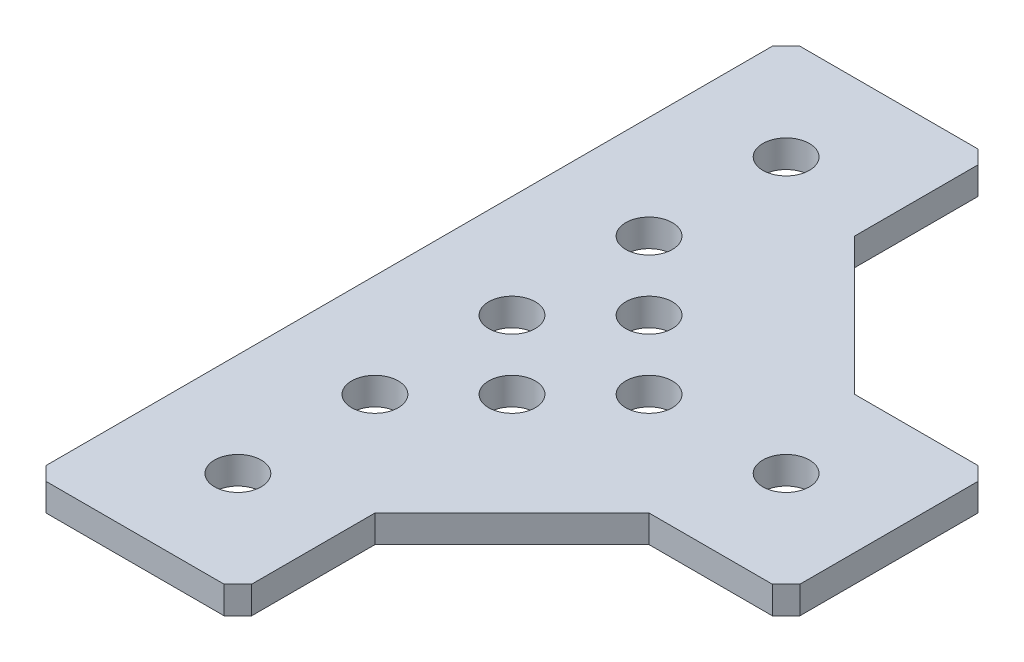
ISO-10303-21;
HEADER;
FILE_DESCRIPTION(('STEP AP214'),'2;1');
FILE_NAME('part.step','',(''),(''),'','','');
FILE_SCHEMA(('AUTOMOTIVE_DESIGN { 1 0 10303 214 1 1 1 1 }'));
ENDSEC;
DATA;
#1=APPLICATION_CONTEXT('core data for automotive mechanical design processes');
#2=APPLICATION_PROTOCOL_DEFINITION('international standard','automotive_design',2000,#1);
#3=PRODUCT_CONTEXT('',#1,'mechanical');
#4=PRODUCT('Part','Part','',(#3));
#5=PRODUCT_RELATED_PRODUCT_CATEGORY('part','',(#4));
#6=PRODUCT_DEFINITION_FORMATION('','',#4);
#7=PRODUCT_DEFINITION_CONTEXT('part definition',#1,'design');
#8=PRODUCT_DEFINITION('design','',#6,#7);
#9=PRODUCT_DEFINITION_SHAPE('','',#8);
#10=(LENGTH_UNIT() NAMED_UNIT(*) SI_UNIT(.MILLI.,.METRE.));
#11=(NAMED_UNIT(*) PLANE_ANGLE_UNIT() SI_UNIT($,.RADIAN.));
#12=(NAMED_UNIT(*) SI_UNIT($,.STERADIAN.) SOLID_ANGLE_UNIT());
#13=UNCERTAINTY_MEASURE_WITH_UNIT(LENGTH_MEASURE(1.E-05),#10,'distance_accuracy_value','');
#14=(GEOMETRIC_REPRESENTATION_CONTEXT(3) GLOBAL_UNCERTAINTY_ASSIGNED_CONTEXT((#13)) GLOBAL_UNIT_ASSIGNED_CONTEXT((#10,
#11,#12)) REPRESENTATION_CONTEXT('',''));
#15=CARTESIAN_POINT('',(0.,0.,0.));
#16=DIRECTION('',(0.,0.,1.));
#17=DIRECTION('',(1.,0.,0.));
#18=AXIS2_PLACEMENT_3D('',#15,#16,#17);
#19=CARTESIAN_POINT('',(27.5,2.,6.49999999999989));
#20=DIRECTION('',(-0.707106781186551,0.,-0.707106781186544));
#21=DIRECTION('',(-0.707106781186544,0.,0.707106781186551));
#22=AXIS2_PLACEMENT_3D('',#19,#20,#21);
#23=PLANE('',#22);
#24=DIRECTION('',(0.,1.,0.));
#25=VECTOR('',#24,1.);
#26=CARTESIAN_POINT('',(26.5,2.,7.49999999999991));
#27=LINE('',#26,#25);
#28=CARTESIAN_POINT('',(26.5,2.,7.49999999999992));
#29=VERTEX_POINT('',#28);
#30=CARTESIAN_POINT('',(26.5,0.,7.49999999999992));
#31=VERTEX_POINT('',#30);
#32=EDGE_CURVE('E131',#29,#31,#27,.F.);
#33=ORIENTED_EDGE('',*,*,#32,.T.);
#34=DIRECTION('',(0.707106781186544,0.,-0.707106781186551));
#35=VECTOR('',#34,1.);
#36=CARTESIAN_POINT('',(26.5,0.,7.49999999999991));
#37=LINE('',#36,#35);
#38=CARTESIAN_POINT('',(27.5,0.,6.49999999999989));
#39=VERTEX_POINT('',#38);
#40=EDGE_CURVE('E134',#31,#39,#37,.T.);
#41=ORIENTED_EDGE('',*,*,#40,.T.);
#42=DIRECTION('',(0.,1.,0.));
#43=VECTOR('',#42,1.);
#44=CARTESIAN_POINT('',(27.5,2.,6.49999999999989));
#45=LINE('',#44,#43);
#46=CARTESIAN_POINT('',(27.5,2.,6.49999999999989));
#47=VERTEX_POINT('',#46);
#48=EDGE_CURVE('E541',#39,#47,#45,.T.);
#49=ORIENTED_EDGE('',*,*,#48,.T.);
#50=DIRECTION('',(-0.707106781186544,0.,0.707106781186551));
#51=VECTOR('',#50,1.);
#52=CARTESIAN_POINT('',(27.5,2.,6.49999999999989));
#53=LINE('',#52,#51);
#54=EDGE_CURVE('E136',#29,#47,#53,.F.);
#55=ORIENTED_EDGE('',*,*,#54,.F.);
#56=EDGE_LOOP('',(#33,#41,#49,#55));
#57=FACE_BOUND('',#56,.T.);
#58=ADVANCED_FACE('F17',(#57),#23,.F.);
#59=CARTESIAN_POINT('',(26.5000000000001,2.,-7.5));
#60=DIRECTION('',(-0.707106781186545,0.,0.70710678118655));
#61=DIRECTION('',(0.70710678118655,0.,0.707106781186545));
#62=AXIS2_PLACEMENT_3D('',#59,#60,#61);
#63=PLANE('',#62);
#64=DIRECTION('',(0.,1.,0.));
#65=VECTOR('',#64,1.);
#66=CARTESIAN_POINT('',(27.5,2.,-6.5000000000001));
#67=LINE('',#66,#65);
#68=CARTESIAN_POINT('',(27.5,2.,-6.50000000000009));
#69=VERTEX_POINT('',#68);
#70=CARTESIAN_POINT('',(27.5,0.,-6.50000000000009));
#71=VERTEX_POINT('',#70);
#72=EDGE_CURVE('E126',#69,#71,#67,.F.);
#73=ORIENTED_EDGE('',*,*,#72,.T.);
#74=DIRECTION('',(-0.70710678118655,0.,-0.707106781186545));
#75=VECTOR('',#74,1.);
#76=CARTESIAN_POINT('',(27.5,0.,-6.5000000000001));
#77=LINE('',#76,#75);
#78=CARTESIAN_POINT('',(26.5000000000001,0.,-7.5));
#79=VERTEX_POINT('',#78);
#80=EDGE_CURVE('E168',#71,#79,#77,.T.);
#81=ORIENTED_EDGE('',*,*,#80,.T.);
#82=DIRECTION('',(0.,1.,0.));
#83=VECTOR('',#82,1.);
#84=CARTESIAN_POINT('',(26.5000000000001,2.,-7.5));
#85=LINE('',#84,#83);
#86=CARTESIAN_POINT('',(26.5000000000001,2.,-7.5));
#87=VERTEX_POINT('',#86);
#88=EDGE_CURVE('E535',#79,#87,#85,.T.);
#89=ORIENTED_EDGE('',*,*,#88,.T.);
#90=DIRECTION('',(0.70710678118655,0.,0.707106781186545));
#91=VECTOR('',#90,1.);
#92=CARTESIAN_POINT('',(26.5000000000001,2.,-7.5));
#93=LINE('',#92,#91);
#94=EDGE_CURVE('E178',#69,#87,#93,.F.);
#95=ORIENTED_EDGE('',*,*,#94,.F.);
#96=EDGE_LOOP('',(#73,#81,#89,#95));
#97=FACE_BOUND('',#96,.T.);
#98=ADVANCED_FACE('F481',(#97),#63,.F.);
#99=CARTESIAN_POINT('',(6.49999999999999,2.,-27.5));
#100=DIRECTION('',(-0.707106781186549,0.,0.707106781186546));
#101=DIRECTION('',(0.707106781186546,0.,0.707106781186549));
#102=AXIS2_PLACEMENT_3D('',#99,#100,#101);
#103=PLANE('',#102);
#104=DIRECTION('',(0.,1.,0.));
#105=VECTOR('',#104,1.);
#106=CARTESIAN_POINT('',(7.50000000000001,2.,-26.5));
#107=LINE('',#106,#105);
#108=CARTESIAN_POINT('',(7.50000000000001,2.,-26.5));
#109=VERTEX_POINT('',#108);
#110=CARTESIAN_POINT('',(7.50000000000001,0.,-26.5));
#111=VERTEX_POINT('',#110);
#112=EDGE_CURVE('E507',#109,#111,#107,.F.);
#113=ORIENTED_EDGE('',*,*,#112,.T.);
#114=DIRECTION('',(-0.707106781186546,0.,-0.707106781186549));
#115=VECTOR('',#114,1.);
#116=CARTESIAN_POINT('',(7.50000000000001,0.,-26.5));
#117=LINE('',#116,#115);
#118=CARTESIAN_POINT('',(6.49999999999999,0.,-27.5));
#119=VERTEX_POINT('',#118);
#120=EDGE_CURVE('E166',#111,#119,#117,.T.);
#121=ORIENTED_EDGE('',*,*,#120,.T.);
#122=DIRECTION('',(0.,1.,0.));
#123=VECTOR('',#122,1.);
#124=CARTESIAN_POINT('',(6.49999999999999,2.,-27.5));
#125=LINE('',#124,#123);
#126=CARTESIAN_POINT('',(6.49999999999999,2.,-27.5));
#127=VERTEX_POINT('',#126);
#128=EDGE_CURVE('E580',#119,#127,#125,.T.);
#129=ORIENTED_EDGE('',*,*,#128,.T.);
#130=DIRECTION('',(0.707106781186546,0.,0.707106781186549));
#131=VECTOR('',#130,1.);
#132=CARTESIAN_POINT('',(6.49999999999999,2.,-27.5));
#133=LINE('',#132,#131);
#134=EDGE_CURVE('E176',#109,#127,#133,.F.);
#135=ORIENTED_EDGE('',*,*,#134,.F.);
#136=EDGE_LOOP('',(#113,#121,#129,#135));
#137=FACE_BOUND('',#136,.T.);
#138=ADVANCED_FACE('F472',(#137),#103,.F.);
#139=CARTESIAN_POINT('',(-7.49999999999999,2.,-26.5));
#140=DIRECTION('',(0.707106781186546,0.,0.707106781186549));
#141=DIRECTION('',(0.707106781186549,0.,-0.707106781186546));
#142=AXIS2_PLACEMENT_3D('',#139,#140,#141);
#143=PLANE('',#142);
#144=DIRECTION('',(0.,1.,0.));
#145=VECTOR('',#144,1.);
#146=CARTESIAN_POINT('',(-6.5,2.,-27.5));
#147=LINE('',#146,#145);
#148=CARTESIAN_POINT('',(-6.5,2.,-27.5));
#149=VERTEX_POINT('',#148);
#150=CARTESIAN_POINT('',(-6.5,0.,-27.5));
#151=VERTEX_POINT('',#150);
#152=EDGE_CURVE('E524',#149,#151,#147,.F.);
#153=ORIENTED_EDGE('',*,*,#152,.T.);
#154=DIRECTION('',(-0.70710678118655,0.,0.707106781186545));
#155=VECTOR('',#154,1.);
#156=CARTESIAN_POINT('',(-6.50000000000001,0.,-27.5));
#157=LINE('',#156,#155);
#158=CARTESIAN_POINT('',(-7.5,0.,-26.5));
#159=VERTEX_POINT('',#158);
#160=EDGE_CURVE('E164',#151,#159,#157,.T.);
#161=ORIENTED_EDGE('',*,*,#160,.T.);
#162=DIRECTION('',(0.,1.,0.));
#163=VECTOR('',#162,1.);
#164=CARTESIAN_POINT('',(-7.49999999999999,2.,-26.5));
#165=LINE('',#164,#163);
#166=CARTESIAN_POINT('',(-7.5,2.,-26.5));
#167=VERTEX_POINT('',#166);
#168=EDGE_CURVE('E572',#159,#167,#165,.T.);
#169=ORIENTED_EDGE('',*,*,#168,.T.);
#170=DIRECTION('',(0.707106781186549,0.,-0.707106781186546));
#171=VECTOR('',#170,1.);
#172=CARTESIAN_POINT('',(-7.49999999999999,2.,-26.5));
#173=LINE('',#172,#171);
#174=EDGE_CURVE('E174',#149,#167,#173,.F.);
#175=ORIENTED_EDGE('',*,*,#174,.F.);
#176=EDGE_LOOP('',(#153,#161,#169,#175));
#177=FACE_BOUND('',#176,.T.);
#178=ADVANCED_FACE('F463',(#177),#143,.F.);
#179=CARTESIAN_POINT('',(-6.49999999999999,2.,27.5));
#180=DIRECTION('',(0.707106781186549,0.,-0.707106781186546));
#181=DIRECTION('',(-0.707106781186546,0.,-0.707106781186549));
#182=AXIS2_PLACEMENT_3D('',#179,#180,#181);
#183=PLANE('',#182);
#184=DIRECTION('',(0.,1.,0.));
#185=VECTOR('',#184,1.);
#186=CARTESIAN_POINT('',(-7.50000000000001,2.,26.5));
#187=LINE('',#186,#185);
#188=CARTESIAN_POINT('',(-7.5,2.,26.5));
#189=VERTEX_POINT('',#188);
#190=CARTESIAN_POINT('',(-7.5,0.,26.5));
#191=VERTEX_POINT('',#190);
#192=EDGE_CURVE('E578',#189,#191,#187,.F.);
#193=ORIENTED_EDGE('',*,*,#192,.T.);
#194=DIRECTION('',(0.707106781186546,0.,0.707106781186549));
#195=VECTOR('',#194,1.);
#196=CARTESIAN_POINT('',(-7.50000000000001,0.,26.5));
#197=LINE('',#196,#195);
#198=CARTESIAN_POINT('',(-6.49999999999999,0.,27.5));
#199=VERTEX_POINT('',#198);
#200=EDGE_CURVE('E162',#191,#199,#197,.T.);
#201=ORIENTED_EDGE('',*,*,#200,.T.);
#202=DIRECTION('',(0.,1.,0.));
#203=VECTOR('',#202,1.);
#204=CARTESIAN_POINT('',(-6.49999999999999,2.,27.5));
#205=LINE('',#204,#203);
#206=CARTESIAN_POINT('',(-6.49999999999999,2.,27.5));
#207=VERTEX_POINT('',#206);
#208=EDGE_CURVE('E564',#199,#207,#205,.T.);
#209=ORIENTED_EDGE('',*,*,#208,.T.);
#210=DIRECTION('',(-0.707106781186546,0.,-0.707106781186549));
#211=VECTOR('',#210,1.);
#212=CARTESIAN_POINT('',(-6.49999999999999,2.,27.5));
#213=LINE('',#212,#211);
#214=EDGE_CURVE('E172',#189,#207,#213,.F.);
#215=ORIENTED_EDGE('',*,*,#214,.F.);
#216=EDGE_LOOP('',(#193,#201,#209,#215));
#217=FACE_BOUND('',#216,.T.);
#218=ADVANCED_FACE('F454',(#217),#183,.F.);
#219=CARTESIAN_POINT('',(7.50000000000001,2.,26.5));
#220=DIRECTION('',(-0.707106781186546,0.,-0.707106781186549));
#221=DIRECTION('',(-0.707106781186549,0.,0.707106781186546));
#222=AXIS2_PLACEMENT_3D('',#219,#220,#221);
#223=PLANE('',#222);
#224=DIRECTION('',(0.,1.,0.));
#225=VECTOR('',#224,1.);
#226=CARTESIAN_POINT('',(6.50000000000001,2.,27.5));
#227=LINE('',#226,#225);
#228=CARTESIAN_POINT('',(6.50000000000001,2.,27.5));
#229=VERTEX_POINT('',#228);
#230=CARTESIAN_POINT('',(6.50000000000001,0.,27.5));
#231=VERTEX_POINT('',#230);
#232=EDGE_CURVE('E570',#229,#231,#227,.F.);
#233=ORIENTED_EDGE('',*,*,#232,.T.);
#234=DIRECTION('',(0.707106781186549,0.,-0.707106781186546));
#235=VECTOR('',#234,1.);
#236=CARTESIAN_POINT('',(6.50000000000001,0.,27.5));
#237=LINE('',#236,#235);
#238=CARTESIAN_POINT('',(7.50000000000001,0.,26.5));
#239=VERTEX_POINT('',#238);
#240=EDGE_CURVE('E151',#231,#239,#237,.T.);
#241=ORIENTED_EDGE('',*,*,#240,.T.);
#242=DIRECTION('',(0.,1.,0.));
#243=VECTOR('',#242,1.);
#244=CARTESIAN_POINT('',(7.50000000000001,2.,26.5));
#245=LINE('',#244,#243);
#246=CARTESIAN_POINT('',(7.50000000000001,2.,26.5));
#247=VERTEX_POINT('',#246);
#248=EDGE_CURVE('E558',#239,#247,#245,.T.);
#249=ORIENTED_EDGE('',*,*,#248,.T.);
#250=DIRECTION('',(-0.707106781186549,0.,0.707106781186546));
#251=VECTOR('',#250,1.);
#252=CARTESIAN_POINT('',(7.50000000000001,2.,26.5));
#253=LINE('',#252,#251);
#254=EDGE_CURVE('E170',#229,#247,#253,.F.);
#255=ORIENTED_EDGE('',*,*,#254,.F.);
#256=EDGE_LOOP('',(#233,#241,#249,#255));
#257=FACE_BOUND('',#256,.T.);
#258=ADVANCED_FACE('F244',(#257),#223,.F.);
#259=CARTESIAN_POINT('',(0.,0.,0.));
#260=DIRECTION('',(0.,1.,0.));
#261=DIRECTION('',(0.,0.,1.));
#262=AXIS2_PLACEMENT_3D('',#259,#260,#261);
#263=PLANE('',#262);
#264=CARTESIAN_POINT('',(0.,0.,20.));
#265=DIRECTION('',(0.,-1.,0.));
#266=DIRECTION('',(0.,0.,-1.));
#267=AXIS2_PLACEMENT_3D('',#264,#265,#266);
#268=CIRCLE('',#267,1.7);
#269=CARTESIAN_POINT('',(0.,0.,18.3));
#270=VERTEX_POINT('',#269);
#271=EDGE_CURVE('E206',#270,#270,#268,.F.);
#272=ORIENTED_EDGE('',*,*,#271,.T.);
#273=EDGE_LOOP('',(#272));
#274=FACE_BOUND('',#273,.T.);
#275=CARTESIAN_POINT('',(0.,0.,10.));
#276=DIRECTION('',(0.,-1.,0.));
#277=DIRECTION('',(0.,0.,-1.));
#278=AXIS2_PLACEMENT_3D('',#275,#276,#277);
#279=CIRCLE('',#278,1.7);
#280=CARTESIAN_POINT('',(0.,0.,8.30000000000001));
#281=VERTEX_POINT('',#280);
#282=EDGE_CURVE('E209',#281,#281,#279,.F.);
#283=ORIENTED_EDGE('',*,*,#282,.T.);
#284=EDGE_LOOP('',(#283));
#285=FACE_BOUND('',#284,.T.);
#286=CARTESIAN_POINT('',(20.,0.,0.));
#287=DIRECTION('',(0.,-1.,0.));
#288=DIRECTION('',(0.,0.,-1.));
#289=AXIS2_PLACEMENT_3D('',#286,#287,#288);
#290=CIRCLE('',#289,1.7);
#291=CARTESIAN_POINT('',(20.,0.,-1.70000000000008));
#292=VERTEX_POINT('',#291);
#293=EDGE_CURVE('E212',#292,#292,#290,.F.);
#294=ORIENTED_EDGE('',*,*,#293,.T.);
#295=EDGE_LOOP('',(#294));
#296=FACE_BOUND('',#295,.T.);
#297=CARTESIAN_POINT('',(10.,0.,0.));
#298=DIRECTION('',(0.,-1.,0.));
#299=DIRECTION('',(0.,0.,-1.));
#300=AXIS2_PLACEMENT_3D('',#297,#298,#299);
#301=CIRCLE('',#300,1.7);
#302=CARTESIAN_POINT('',(10.,0.,-1.70000000000004));
#303=VERTEX_POINT('',#302);
#304=EDGE_CURVE('E215',#303,#303,#301,.F.);
#305=ORIENTED_EDGE('',*,*,#304,.T.);
#306=EDGE_LOOP('',(#305));
#307=FACE_BOUND('',#306,.T.);
#308=CARTESIAN_POINT('',(0.,0.,-10.));
#309=DIRECTION('',(0.,-1.,0.));
#310=DIRECTION('',(0.,0.,-1.));
#311=AXIS2_PLACEMENT_3D('',#308,#309,#310);
#312=CIRCLE('',#311,1.7);
#313=CARTESIAN_POINT('',(0.,0.,-11.7));
#314=VERTEX_POINT('',#313);
#315=EDGE_CURVE('E218',#314,#314,#312,.F.);
#316=ORIENTED_EDGE('',*,*,#315,.T.);
#317=EDGE_LOOP('',(#316));
#318=FACE_BOUND('',#317,.T.);
#319=CARTESIAN_POINT('',(0.,0.,-20.));
#320=DIRECTION('',(0.,-1.,0.));
#321=DIRECTION('',(0.,0.,-1.));
#322=AXIS2_PLACEMENT_3D('',#319,#320,#321);
#323=CIRCLE('',#322,1.7);
#324=CARTESIAN_POINT('',(0.,0.,-21.7));
#325=VERTEX_POINT('',#324);
#326=EDGE_CURVE('E221',#325,#325,#323,.F.);
#327=ORIENTED_EDGE('',*,*,#326,.T.);
#328=EDGE_LOOP('',(#327));
#329=FACE_BOUND('',#328,.T.);
#330=CARTESIAN_POINT('',(0.,0.,0.));
#331=DIRECTION('',(0.,-1.,0.));
#332=DIRECTION('',(0.,0.,-1.));
#333=AXIS2_PLACEMENT_3D('',#330,#331,#332);
#334=CIRCLE('',#333,1.7);
#335=CARTESIAN_POINT('',(0.,0.,-1.69999999999999));
#336=VERTEX_POINT('',#335);
#337=EDGE_CURVE('E224',#336,#336,#334,.F.);
#338=ORIENTED_EDGE('',*,*,#337,.T.);
#339=EDGE_LOOP('',(#338));
#340=FACE_BOUND('',#339,.T.);
#341=ORIENTED_EDGE('',*,*,#40,.F.);
#342=DIRECTION('',(-1.,0.,0.));
#343=VECTOR('',#342,1.);
#344=CARTESIAN_POINT('',(-7.49999999999997,0.,7.50000000000002));
#345=LINE('',#344,#343);
#346=CARTESIAN_POINT('',(17.5000000000001,0.,7.49999999999994));
#347=VERTEX_POINT('',#346);
#348=EDGE_CURVE('E140',#31,#347,#345,.T.);
#349=ORIENTED_EDGE('',*,*,#348,.T.);
#350=DIRECTION('',(0.707106781186551,0.,-0.707106781186544));
#351=VECTOR('',#350,1.);
#352=CARTESIAN_POINT('',(17.5000000000001,0.,7.49999999999994));
#353=LINE('',#352,#351);
#354=CARTESIAN_POINT('',(7.50000000000001,0.,17.4999999999999));
#355=VERTEX_POINT('',#354);
#356=EDGE_CURVE('E555',#355,#347,#353,.T.);
#357=ORIENTED_EDGE('',*,*,#356,.F.);
#358=DIRECTION('',(0.,0.,1.));
#359=VECTOR('',#358,1.);
#360=CARTESIAN_POINT('',(7.50000000000001,0.,-7.5));
#361=LINE('',#360,#359);
#362=EDGE_CURVE('E561',#355,#239,#361,.T.);
#363=ORIENTED_EDGE('',*,*,#362,.T.);
#364=ORIENTED_EDGE('',*,*,#240,.F.);
#365=DIRECTION('',(-1.,0.,0.));
#366=VECTOR('',#365,1.);
#367=CARTESIAN_POINT('',(-7.5,0.,27.5));
#368=LINE('',#367,#366);
#369=EDGE_CURVE('E567',#231,#199,#368,.T.);
#370=ORIENTED_EDGE('',*,*,#369,.T.);
#371=ORIENTED_EDGE('',*,*,#200,.F.);
#372=DIRECTION('',(0.,0.,-1.));
#373=VECTOR('',#372,1.);
#374=CARTESIAN_POINT('',(-7.5,0.,-7.5));
#375=LINE('',#374,#373);
#376=EDGE_CURVE('E575',#191,#159,#375,.T.);
#377=ORIENTED_EDGE('',*,*,#376,.T.);
#378=ORIENTED_EDGE('',*,*,#160,.F.);
#379=DIRECTION('',(1.,0.,0.));
#380=VECTOR('',#379,1.);
#381=CARTESIAN_POINT('',(7.5,0.,-27.5));
#382=LINE('',#381,#380);
#383=EDGE_CURVE('E522',#151,#119,#382,.T.);
#384=ORIENTED_EDGE('',*,*,#383,.T.);
#385=ORIENTED_EDGE('',*,*,#120,.F.);
#386=DIRECTION('',(0.,0.,1.));
#387=VECTOR('',#386,1.);
#388=CARTESIAN_POINT('',(7.5,0.,7.5));
#389=LINE('',#388,#387);
#390=CARTESIAN_POINT('',(7.50000000000001,0.,-17.5000000000001));
#391=VERTEX_POINT('',#390);
#392=EDGE_CURVE('E514',#111,#391,#389,.T.);
#393=ORIENTED_EDGE('',*,*,#392,.T.);
#394=DIRECTION('',(-0.707106781186544,0.,-0.707106781186551));
#395=VECTOR('',#394,1.);
#396=CARTESIAN_POINT('',(7.50000000000001,0.,-17.5000000000001));
#397=LINE('',#396,#395);
#398=CARTESIAN_POINT('',(17.5,0.,-7.5));
#399=VERTEX_POINT('',#398);
#400=EDGE_CURVE('E530',#399,#391,#397,.T.);
#401=ORIENTED_EDGE('',*,*,#400,.F.);
#402=DIRECTION('',(1.,0.,0.));
#403=VECTOR('',#402,1.);
#404=CARTESIAN_POINT('',(-7.5,0.,-7.5));
#405=LINE('',#404,#403);
#406=EDGE_CURVE('E538',#399,#79,#405,.T.);
#407=ORIENTED_EDGE('',*,*,#406,.T.);
#408=ORIENTED_EDGE('',*,*,#80,.F.);
#409=DIRECTION('',(0.,0.,1.));
#410=VECTOR('',#409,1.);
#411=CARTESIAN_POINT('',(27.5,0.,7.4999999999999));
#412=LINE('',#411,#410);
#413=EDGE_CURVE('E149',#71,#39,#412,.T.);
#414=ORIENTED_EDGE('',*,*,#413,.T.);
#415=EDGE_LOOP('',(#341,#349,#357,#363,#364,#370,#371,#377,#378,#384,#385,#393,#401,#407,#408,#414));
#416=FACE_BOUND('',#415,.T.);
#417=CARTESIAN_POINT('',(5.,0.,5.00000000000001));
#418=DIRECTION('',(0.,1.,0.));
#419=DIRECTION('',(0.,0.,1.));
#420=AXIS2_PLACEMENT_3D('',#417,#418,#419);
#421=CIRCLE('',#420,1.7);
#422=CARTESIAN_POINT('',(5.,0.,6.70000000000001));
#423=VERTEX_POINT('',#422);
#424=EDGE_CURVE('E141',#423,#423,#421,.T.);
#425=ORIENTED_EDGE('',*,*,#424,.T.);
#426=EDGE_LOOP('',(#425));
#427=FACE_BOUND('',#426,.T.);
#428=CARTESIAN_POINT('',(5.,0.,-4.99999999999999));
#429=DIRECTION('',(0.,1.,0.));
#430=DIRECTION('',(0.,0.,1.));
#431=AXIS2_PLACEMENT_3D('',#428,#429,#430);
#432=CIRCLE('',#431,1.7);
#433=CARTESIAN_POINT('',(5.,0.,-3.29999999999999));
#434=VERTEX_POINT('',#433);
#435=EDGE_CURVE('E20',#434,#434,#432,.T.);
#436=ORIENTED_EDGE('',*,*,#435,.T.);
#437=EDGE_LOOP('',(#436));
#438=FACE_BOUND('',#437,.T.);
#439=ADVANCED_FACE('F144',(#274,#285,#296,#307,#318,#329,#340,#416,#427,#438),#263,.F.);
#440=CARTESIAN_POINT('',(5.,-1.175,-4.99999999999999));
#441=DIRECTION('',(0.,1.,0.));
#442=DIRECTION('',(0.,0.,1.));
#443=AXIS2_PLACEMENT_3D('',#440,#441,#442);
#444=CYLINDRICAL_SURFACE('',#443,1.7);
#445=CARTESIAN_POINT('',(5.,2.,-4.99999999999999));
#446=DIRECTION('',(0.,1.,0.));
#447=DIRECTION('',(0.,0.,1.));
#448=AXIS2_PLACEMENT_3D('',#445,#446,#447);
#449=CIRCLE('',#448,1.7);
#450=CARTESIAN_POINT('',(5.,2.,-3.29999999999999));
#451=VERTEX_POINT('',#450);
#452=EDGE_CURVE('E203',#451,#451,#449,.F.);
#453=ORIENTED_EDGE('',*,*,#452,.F.);
#454=EDGE_LOOP('',(#453));
#455=FACE_BOUND('',#454,.T.);
#456=ORIENTED_EDGE('',*,*,#435,.F.);
#457=EDGE_LOOP('',(#456));
#458=FACE_BOUND('',#457,.T.);
#459=ADVANCED_FACE('F232',(#455,#458),#444,.F.);
#460=CARTESIAN_POINT('',(5.,-1.175,5.00000000000001));
#461=DIRECTION('',(0.,1.,0.));
#462=DIRECTION('',(0.,0.,1.));
#463=AXIS2_PLACEMENT_3D('',#460,#461,#462);
#464=CYLINDRICAL_SURFACE('',#463,1.7);
#465=CARTESIAN_POINT('',(5.,2.,5.00000000000001));
#466=DIRECTION('',(0.,1.,0.));
#467=DIRECTION('',(0.,0.,1.));
#468=AXIS2_PLACEMENT_3D('',#465,#466,#467);
#469=CIRCLE('',#468,1.7);
#470=CARTESIAN_POINT('',(5.,2.,6.70000000000001));
#471=VERTEX_POINT('',#470);
#472=EDGE_CURVE('E199',#471,#471,#469,.F.);
#473=ORIENTED_EDGE('',*,*,#472,.F.);
#474=EDGE_LOOP('',(#473));
#475=FACE_BOUND('',#474,.T.);
#476=ORIENTED_EDGE('',*,*,#424,.F.);
#477=EDGE_LOOP('',(#476));
#478=FACE_BOUND('',#477,.T.);
#479=ADVANCED_FACE('F234',(#475,#478),#464,.F.);
#480=CARTESIAN_POINT('',(-7.49999999999997,2.,7.50000000000002));
#481=DIRECTION('',(0.,0.,-1.));
#482=DIRECTION('',(-1.,0.,0.));
#483=AXIS2_PLACEMENT_3D('',#480,#481,#482);
#484=PLANE('',#483);
#485=ORIENTED_EDGE('',*,*,#32,.F.);
#486=DIRECTION('',(1.,0.,0.));
#487=VECTOR('',#486,1.);
#488=CARTESIAN_POINT('',(0.,2.,7.49999999999994));
#489=LINE('',#488,#487);
#490=CARTESIAN_POINT('',(17.5000000000001,2.,7.49999999999994));
#491=VERTEX_POINT('',#490);
#492=EDGE_CURVE('E202',#491,#29,#489,.T.);
#493=ORIENTED_EDGE('',*,*,#492,.F.);
#494=DIRECTION('',(0.,1.,0.));
#495=VECTOR('',#494,1.);
#496=CARTESIAN_POINT('',(17.5000000000001,2.,7.49999999999994));
#497=LINE('',#496,#495);
#498=EDGE_CURVE('E155',#347,#491,#497,.T.);
#499=ORIENTED_EDGE('',*,*,#498,.F.);
#500=ORIENTED_EDGE('',*,*,#348,.F.);
#501=EDGE_LOOP('',(#485,#493,#499,#500));
#502=FACE_BOUND('',#501,.T.);
#503=ADVANCED_FACE('F153',(#502),#484,.F.);
#504=CARTESIAN_POINT('',(27.5,2.,7.4999999999999));
#505=DIRECTION('',(-1.,0.,0.));
#506=DIRECTION('',(0.,0.,1.));
#507=AXIS2_PLACEMENT_3D('',#504,#505,#506);
#508=PLANE('',#507);
#509=ORIENTED_EDGE('',*,*,#48,.F.);
#510=ORIENTED_EDGE('',*,*,#413,.F.);
#511=ORIENTED_EDGE('',*,*,#72,.F.);
#512=DIRECTION('',(0.,0.,1.));
#513=VECTOR('',#512,1.);
#514=CARTESIAN_POINT('',(27.5,2.,0.));
#515=LINE('',#514,#513);
#516=EDGE_CURVE('E544',#47,#69,#515,.F.);
#517=ORIENTED_EDGE('',*,*,#516,.F.);
#518=EDGE_LOOP('',(#509,#510,#511,#517));
#519=FACE_BOUND('',#518,.T.);
#520=ADVANCED_FACE('F314',(#519),#508,.F.);
#521=CARTESIAN_POINT('',(-7.5,2.,-7.5));
#522=DIRECTION('',(0.,0.,1.));
#523=DIRECTION('',(1.,0.,0.));
#524=AXIS2_PLACEMENT_3D('',#521,#522,#523);
#525=PLANE('',#524);
#526=ORIENTED_EDGE('',*,*,#88,.F.);
#527=ORIENTED_EDGE('',*,*,#406,.F.);
#528=DIRECTION('',(0.,1.,0.));
#529=VECTOR('',#528,1.);
#530=CARTESIAN_POINT('',(17.5,2.,-7.5));
#531=LINE('',#530,#529);
#532=CARTESIAN_POINT('',(17.5,2.,-7.5));
#533=VERTEX_POINT('',#532);
#534=EDGE_CURVE('E532',#533,#399,#531,.F.);
#535=ORIENTED_EDGE('',*,*,#534,.F.);
#536=DIRECTION('',(1.,0.,0.));
#537=VECTOR('',#536,1.);
#538=CARTESIAN_POINT('',(0.,2.,-7.5));
#539=LINE('',#538,#537);
#540=EDGE_CURVE('E546',#87,#533,#539,.F.);
#541=ORIENTED_EDGE('',*,*,#540,.F.);
#542=EDGE_LOOP('',(#526,#527,#535,#541));
#543=FACE_BOUND('',#542,.T.);
#544=ADVANCED_FACE('F310',(#543),#525,.F.);
#545=CARTESIAN_POINT('',(7.50000000000001,2.,-17.5000000000001));
#546=DIRECTION('',(0.707106781186551,0.,-0.707106781186544));
#547=DIRECTION('',(-0.707106781186544,0.,-0.707106781186551));
#548=AXIS2_PLACEMENT_3D('',#545,#546,#547);
#549=PLANE('',#548);
#550=ORIENTED_EDGE('',*,*,#400,.T.);
#551=DIRECTION('',(0.,1.,0.));
#552=VECTOR('',#551,1.);
#553=CARTESIAN_POINT('',(7.50000000000001,2.,-17.5000000000001));
#554=LINE('',#553,#552);
#555=CARTESIAN_POINT('',(7.50000000000001,2.,-17.5000000000001));
#556=VERTEX_POINT('',#555);
#557=EDGE_CURVE('E515',#391,#556,#554,.T.);
#558=ORIENTED_EDGE('',*,*,#557,.T.);
#559=DIRECTION('',(-0.707106781186544,0.,-0.707106781186551));
#560=VECTOR('',#559,1.);
#561=CARTESIAN_POINT('',(17.5,2.,-7.5));
#562=LINE('',#561,#560);
#563=EDGE_CURVE('E549',#533,#556,#562,.T.);
#564=ORIENTED_EDGE('',*,*,#563,.F.);
#565=ORIENTED_EDGE('',*,*,#534,.T.);
#566=EDGE_LOOP('',(#550,#558,#564,#565));
#567=FACE_BOUND('',#566,.T.);
#568=ADVANCED_FACE('F306',(#567),#549,.T.);
#569=CARTESIAN_POINT('',(7.5,2.,7.5));
#570=DIRECTION('',(-1.,0.,0.));
#571=DIRECTION('',(0.,0.,1.));
#572=AXIS2_PLACEMENT_3D('',#569,#570,#571);
#573=PLANE('',#572);
#574=ORIENTED_EDGE('',*,*,#112,.F.);
#575=DIRECTION('',(0.,0.,1.));
#576=VECTOR('',#575,1.);
#577=CARTESIAN_POINT('',(7.50000000000001,2.,0.));
#578=LINE('',#577,#576);
#579=EDGE_CURVE('E586',#556,#109,#578,.F.);
#580=ORIENTED_EDGE('',*,*,#579,.F.);
#581=ORIENTED_EDGE('',*,*,#557,.F.);
#582=ORIENTED_EDGE('',*,*,#392,.F.);
#583=EDGE_LOOP('',(#574,#580,#581,#582));
#584=FACE_BOUND('',#583,.T.);
#585=ADVANCED_FACE('F302',(#584),#573,.F.);
#586=CARTESIAN_POINT('',(7.5,2.,-27.5));
#587=DIRECTION('',(0.,0.,1.));
#588=DIRECTION('',(1.,0.,0.));
#589=AXIS2_PLACEMENT_3D('',#586,#587,#588);
#590=PLANE('',#589);
#591=ORIENTED_EDGE('',*,*,#128,.F.);
#592=ORIENTED_EDGE('',*,*,#383,.F.);
#593=ORIENTED_EDGE('',*,*,#152,.F.);
#594=DIRECTION('',(1.,0.,0.));
#595=VECTOR('',#594,1.);
#596=CARTESIAN_POINT('',(0.,2.,-27.5));
#597=LINE('',#596,#595);
#598=EDGE_CURVE('E584',#127,#149,#597,.F.);
#599=ORIENTED_EDGE('',*,*,#598,.F.);
#600=EDGE_LOOP('',(#591,#592,#593,#599));
#601=FACE_BOUND('',#600,.T.);
#602=ADVANCED_FACE('F298',(#601),#590,.F.);
#603=CARTESIAN_POINT('',(-7.5,2.,-7.5));
#604=DIRECTION('',(1.,0.,0.));
#605=DIRECTION('',(0.,0.,-1.));
#606=AXIS2_PLACEMENT_3D('',#603,#604,#605);
#607=PLANE('',#606);
#608=ORIENTED_EDGE('',*,*,#168,.F.);
#609=ORIENTED_EDGE('',*,*,#376,.F.);
#610=ORIENTED_EDGE('',*,*,#192,.F.);
#611=DIRECTION('',(0.,0.,1.));
#612=VECTOR('',#611,1.);
#613=CARTESIAN_POINT('',(-7.49999999999999,2.,0.));
#614=LINE('',#613,#612);
#615=EDGE_CURVE('E585',#167,#189,#614,.T.);
#616=ORIENTED_EDGE('',*,*,#615,.F.);
#617=EDGE_LOOP('',(#608,#609,#610,#616));
#618=FACE_BOUND('',#617,.T.);
#619=ADVANCED_FACE('F294',(#618),#607,.F.);
#620=CARTESIAN_POINT('',(-7.5,2.,27.5));
#621=DIRECTION('',(0.,0.,-1.));
#622=DIRECTION('',(-1.,0.,0.));
#623=AXIS2_PLACEMENT_3D('',#620,#621,#622);
#624=PLANE('',#623);
#625=ORIENTED_EDGE('',*,*,#208,.F.);
#626=ORIENTED_EDGE('',*,*,#369,.F.);
#627=ORIENTED_EDGE('',*,*,#232,.F.);
#628=DIRECTION('',(1.,0.,0.));
#629=VECTOR('',#628,1.);
#630=CARTESIAN_POINT('',(0.,2.,27.5));
#631=LINE('',#630,#629);
#632=EDGE_CURVE('E589',#207,#229,#631,.T.);
#633=ORIENTED_EDGE('',*,*,#632,.F.);
#634=EDGE_LOOP('',(#625,#626,#627,#633));
#635=FACE_BOUND('',#634,.T.);
#636=ADVANCED_FACE('F291',(#635),#624,.F.);
#637=CARTESIAN_POINT('',(7.50000000000001,2.,-7.5));
#638=DIRECTION('',(-1.,0.,0.));
#639=DIRECTION('',(0.,0.,1.));
#640=AXIS2_PLACEMENT_3D('',#637,#638,#639);
#641=PLANE('',#640);
#642=ORIENTED_EDGE('',*,*,#248,.F.);
#643=ORIENTED_EDGE('',*,*,#362,.F.);
#644=DIRECTION('',(0.,1.,0.));
#645=VECTOR('',#644,1.);
#646=CARTESIAN_POINT('',(7.50000000000001,2.,17.4999999999999));
#647=LINE('',#646,#645);
#648=CARTESIAN_POINT('',(7.50000000000001,2.,17.4999999999999));
#649=VERTEX_POINT('',#648);
#650=EDGE_CURVE('E35',#649,#355,#647,.F.);
#651=ORIENTED_EDGE('',*,*,#650,.F.);
#652=DIRECTION('',(0.,0.,1.));
#653=VECTOR('',#652,1.);
#654=CARTESIAN_POINT('',(7.50000000000001,2.,0.));
#655=LINE('',#654,#653);
#656=EDGE_CURVE('E600',#247,#649,#655,.F.);
#657=ORIENTED_EDGE('',*,*,#656,.F.);
#658=EDGE_LOOP('',(#642,#643,#651,#657));
#659=FACE_BOUND('',#658,.T.);
#660=ADVANCED_FACE('F287',(#659),#641,.F.);
#661=CARTESIAN_POINT('',(17.5000000000001,2.,7.49999999999994));
#662=DIRECTION('',(0.707106781186544,0.,0.707106781186551));
#663=DIRECTION('',(0.707106781186551,0.,-0.707106781186544));
#664=AXIS2_PLACEMENT_3D('',#661,#662,#663);
#665=PLANE('',#664);
#666=ORIENTED_EDGE('',*,*,#356,.T.);
#667=ORIENTED_EDGE('',*,*,#498,.T.);
#668=DIRECTION('',(0.707106781186551,0.,-0.707106781186544));
#669=VECTOR('',#668,1.);
#670=CARTESIAN_POINT('',(7.50000000000001,2.,17.4999999999999));
#671=LINE('',#670,#669);
#672=EDGE_CURVE('E198',#649,#491,#671,.T.);
#673=ORIENTED_EDGE('',*,*,#672,.F.);
#674=ORIENTED_EDGE('',*,*,#650,.T.);
#675=EDGE_LOOP('',(#666,#667,#673,#674));
#676=FACE_BOUND('',#675,.T.);
#677=ADVANCED_FACE('F283',(#676),#665,.T.);
#678=CARTESIAN_POINT('',(0.,2.,0.));
#679=DIRECTION('',(0.,-1.,0.));
#680=DIRECTION('',(0.,0.,-1.));
#681=AXIS2_PLACEMENT_3D('',#678,#679,#680);
#682=CYLINDRICAL_SURFACE('',#681,1.7);
#683=CARTESIAN_POINT('',(0.,2.,0.));
#684=DIRECTION('',(0.,-1.,0.));
#685=DIRECTION('',(0.,0.,-1.));
#686=AXIS2_PLACEMENT_3D('',#683,#684,#685);
#687=CIRCLE('',#686,1.7);
#688=CARTESIAN_POINT('',(0.,2.,-1.69999999999999));
#689=VERTEX_POINT('',#688);
#690=EDGE_CURVE('E195',#689,#689,#687,.T.);
#691=ORIENTED_EDGE('',*,*,#690,.F.);
#692=EDGE_LOOP('',(#691));
#693=FACE_BOUND('',#692,.T.);
#694=ORIENTED_EDGE('',*,*,#337,.F.);
#695=EDGE_LOOP('',(#694));
#696=FACE_BOUND('',#695,.T.);
#697=ADVANCED_FACE('F279',(#693,#696),#682,.F.);
#698=CARTESIAN_POINT('',(0.,2.,-20.));
#699=DIRECTION('',(0.,-1.,0.));
#700=DIRECTION('',(0.,0.,-1.));
#701=AXIS2_PLACEMENT_3D('',#698,#699,#700);
#702=CYLINDRICAL_SURFACE('',#701,1.7);
#703=CARTESIAN_POINT('',(0.,2.,-20.));
#704=DIRECTION('',(0.,-1.,0.));
#705=DIRECTION('',(0.,0.,-1.));
#706=AXIS2_PLACEMENT_3D('',#703,#704,#705);
#707=CIRCLE('',#706,1.7);
#708=CARTESIAN_POINT('',(0.,2.,-21.7));
#709=VERTEX_POINT('',#708);
#710=EDGE_CURVE('E192',#709,#709,#707,.T.);
#711=ORIENTED_EDGE('',*,*,#710,.F.);
#712=EDGE_LOOP('',(#711));
#713=FACE_BOUND('',#712,.T.);
#714=ORIENTED_EDGE('',*,*,#326,.F.);
#715=EDGE_LOOP('',(#714));
#716=FACE_BOUND('',#715,.T.);
#717=ADVANCED_FACE('F275',(#713,#716),#702,.F.);
#718=CARTESIAN_POINT('',(0.,2.,-10.));
#719=DIRECTION('',(0.,-1.,0.));
#720=DIRECTION('',(0.,0.,-1.));
#721=AXIS2_PLACEMENT_3D('',#718,#719,#720);
#722=CYLINDRICAL_SURFACE('',#721,1.7);
#723=CARTESIAN_POINT('',(0.,2.,-10.));
#724=DIRECTION('',(0.,-1.,0.));
#725=DIRECTION('',(0.,0.,-1.));
#726=AXIS2_PLACEMENT_3D('',#723,#724,#725);
#727=CIRCLE('',#726,1.7);
#728=CARTESIAN_POINT('',(0.,2.,-11.7));
#729=VERTEX_POINT('',#728);
#730=EDGE_CURVE('E189',#729,#729,#727,.T.);
#731=ORIENTED_EDGE('',*,*,#730,.F.);
#732=EDGE_LOOP('',(#731));
#733=FACE_BOUND('',#732,.T.);
#734=ORIENTED_EDGE('',*,*,#315,.F.);
#735=EDGE_LOOP('',(#734));
#736=FACE_BOUND('',#735,.T.);
#737=ADVANCED_FACE('F271',(#733,#736),#722,.F.);
#738=CARTESIAN_POINT('',(10.,2.,0.));
#739=DIRECTION('',(0.,-1.,0.));
#740=DIRECTION('',(0.,0.,-1.));
#741=AXIS2_PLACEMENT_3D('',#738,#739,#740);
#742=CYLINDRICAL_SURFACE('',#741,1.7);
#743=CARTESIAN_POINT('',(10.,2.,0.));
#744=DIRECTION('',(0.,-1.,0.));
#745=DIRECTION('',(0.,0.,-1.));
#746=AXIS2_PLACEMENT_3D('',#743,#744,#745);
#747=CIRCLE('',#746,1.7);
#748=CARTESIAN_POINT('',(10.,2.,-1.70000000000004));
#749=VERTEX_POINT('',#748);
#750=EDGE_CURVE('E186',#749,#749,#747,.T.);
#751=ORIENTED_EDGE('',*,*,#750,.F.);
#752=EDGE_LOOP('',(#751));
#753=FACE_BOUND('',#752,.T.);
#754=ORIENTED_EDGE('',*,*,#304,.F.);
#755=EDGE_LOOP('',(#754));
#756=FACE_BOUND('',#755,.T.);
#757=ADVANCED_FACE('F267',(#753,#756),#742,.F.);
#758=CARTESIAN_POINT('',(20.,2.,0.));
#759=DIRECTION('',(0.,-1.,0.));
#760=DIRECTION('',(0.,0.,-1.));
#761=AXIS2_PLACEMENT_3D('',#758,#759,#760);
#762=CYLINDRICAL_SURFACE('',#761,1.7);
#763=CARTESIAN_POINT('',(20.,2.,0.));
#764=DIRECTION('',(0.,-1.,0.));
#765=DIRECTION('',(0.,0.,-1.));
#766=AXIS2_PLACEMENT_3D('',#763,#764,#765);
#767=CIRCLE('',#766,1.7);
#768=CARTESIAN_POINT('',(20.,2.,-1.70000000000008));
#769=VERTEX_POINT('',#768);
#770=EDGE_CURVE('E183',#769,#769,#767,.T.);
#771=ORIENTED_EDGE('',*,*,#770,.F.);
#772=EDGE_LOOP('',(#771));
#773=FACE_BOUND('',#772,.T.);
#774=ORIENTED_EDGE('',*,*,#293,.F.);
#775=EDGE_LOOP('',(#774));
#776=FACE_BOUND('',#775,.T.);
#777=ADVANCED_FACE('F263',(#773,#776),#762,.F.);
#778=CARTESIAN_POINT('',(0.,2.,10.));
#779=DIRECTION('',(0.,-1.,0.));
#780=DIRECTION('',(0.,0.,-1.));
#781=AXIS2_PLACEMENT_3D('',#778,#779,#780);
#782=CYLINDRICAL_SURFACE('',#781,1.7);
#783=CARTESIAN_POINT('',(0.,2.,10.));
#784=DIRECTION('',(0.,-1.,0.));
#785=DIRECTION('',(0.,0.,-1.));
#786=AXIS2_PLACEMENT_3D('',#783,#784,#785);
#787=CIRCLE('',#786,1.7);
#788=CARTESIAN_POINT('',(0.,2.,8.30000000000001));
#789=VERTEX_POINT('',#788);
#790=EDGE_CURVE('E26',#789,#789,#787,.T.);
#791=ORIENTED_EDGE('',*,*,#790,.F.);
#792=EDGE_LOOP('',(#791));
#793=FACE_BOUND('',#792,.T.);
#794=ORIENTED_EDGE('',*,*,#282,.F.);
#795=EDGE_LOOP('',(#794));
#796=FACE_BOUND('',#795,.T.);
#797=ADVANCED_FACE('F256',(#793,#796),#782,.F.);
#798=CARTESIAN_POINT('',(0.,2.,20.));
#799=DIRECTION('',(0.,-1.,0.));
#800=DIRECTION('',(0.,0.,-1.));
#801=AXIS2_PLACEMENT_3D('',#798,#799,#800);
#802=CYLINDRICAL_SURFACE('',#801,1.7);
#803=CARTESIAN_POINT('',(0.,2.,20.));
#804=DIRECTION('',(0.,-1.,0.));
#805=DIRECTION('',(0.,0.,-1.));
#806=AXIS2_PLACEMENT_3D('',#803,#804,#805);
#807=CIRCLE('',#806,1.7);
#808=CARTESIAN_POINT('',(0.,2.,18.3));
#809=VERTEX_POINT('',#808);
#810=EDGE_CURVE('E10',#809,#809,#807,.T.);
#811=ORIENTED_EDGE('',*,*,#810,.F.);
#812=EDGE_LOOP('',(#811));
#813=FACE_BOUND('',#812,.T.);
#814=ORIENTED_EDGE('',*,*,#271,.F.);
#815=EDGE_LOOP('',(#814));
#816=FACE_BOUND('',#815,.T.);
#817=ADVANCED_FACE('F250',(#813,#816),#802,.F.);
#818=CARTESIAN_POINT('',(0.,2.,0.));
#819=DIRECTION('',(0.,1.,0.));
#820=DIRECTION('',(0.,0.,1.));
#821=AXIS2_PLACEMENT_3D('',#818,#819,#820);
#822=PLANE('',#821);
#823=ORIENTED_EDGE('',*,*,#810,.T.);
#824=EDGE_LOOP('',(#823));
#825=FACE_BOUND('',#824,.T.);
#826=ORIENTED_EDGE('',*,*,#790,.T.);
#827=EDGE_LOOP('',(#826));
#828=FACE_BOUND('',#827,.T.);
#829=ORIENTED_EDGE('',*,*,#770,.T.);
#830=EDGE_LOOP('',(#829));
#831=FACE_BOUND('',#830,.T.);
#832=ORIENTED_EDGE('',*,*,#750,.T.);
#833=EDGE_LOOP('',(#832));
#834=FACE_BOUND('',#833,.T.);
#835=ORIENTED_EDGE('',*,*,#730,.T.);
#836=EDGE_LOOP('',(#835));
#837=FACE_BOUND('',#836,.T.);
#838=ORIENTED_EDGE('',*,*,#710,.T.);
#839=EDGE_LOOP('',(#838));
#840=FACE_BOUND('',#839,.T.);
#841=ORIENTED_EDGE('',*,*,#690,.T.);
#842=EDGE_LOOP('',(#841));
#843=FACE_BOUND('',#842,.T.);
#844=ORIENTED_EDGE('',*,*,#656,.T.);
#845=ORIENTED_EDGE('',*,*,#672,.T.);
#846=ORIENTED_EDGE('',*,*,#492,.T.);
#847=ORIENTED_EDGE('',*,*,#54,.T.);
#848=ORIENTED_EDGE('',*,*,#516,.T.);
#849=ORIENTED_EDGE('',*,*,#94,.T.);
#850=ORIENTED_EDGE('',*,*,#540,.T.);
#851=ORIENTED_EDGE('',*,*,#563,.T.);
#852=ORIENTED_EDGE('',*,*,#579,.T.);
#853=ORIENTED_EDGE('',*,*,#134,.T.);
#854=ORIENTED_EDGE('',*,*,#598,.T.);
#855=ORIENTED_EDGE('',*,*,#174,.T.);
#856=ORIENTED_EDGE('',*,*,#615,.T.);
#857=ORIENTED_EDGE('',*,*,#214,.T.);
#858=ORIENTED_EDGE('',*,*,#632,.T.);
#859=ORIENTED_EDGE('',*,*,#254,.T.);
#860=EDGE_LOOP('',(#844,#845,#846,#847,#848,#849,#850,#851,#852,#853,#854,#855,#856,#857,#858,#859));
#861=FACE_BOUND('',#860,.T.);
#862=ORIENTED_EDGE('',*,*,#472,.T.);
#863=EDGE_LOOP('',(#862));
#864=FACE_BOUND('',#863,.T.);
#865=ORIENTED_EDGE('',*,*,#452,.T.);
#866=EDGE_LOOP('',(#865));
#867=FACE_BOUND('',#866,.T.);
#868=ADVANCED_FACE('F248',(#825,#828,#831,#834,#837,#840,#843,#861,#864,#867),#822,.T.);
#869=CLOSED_SHELL('',(#58,#98,#138,#178,#218,#258,#439,#459,#479,#503,#520,#544,#568,#585,#602,
#619,#636,#660,#677,#697,#717,#737,#757,#777,#797,#817,#868));
#870=MANIFOLD_SOLID_BREP('B1',#869);
#871=ADVANCED_BREP_SHAPE_REPRESENTATION('',(#18,#870),#14);
#872=SHAPE_DEFINITION_REPRESENTATION(#9,#871);
ENDSEC;
END-ISO-10303-21;
